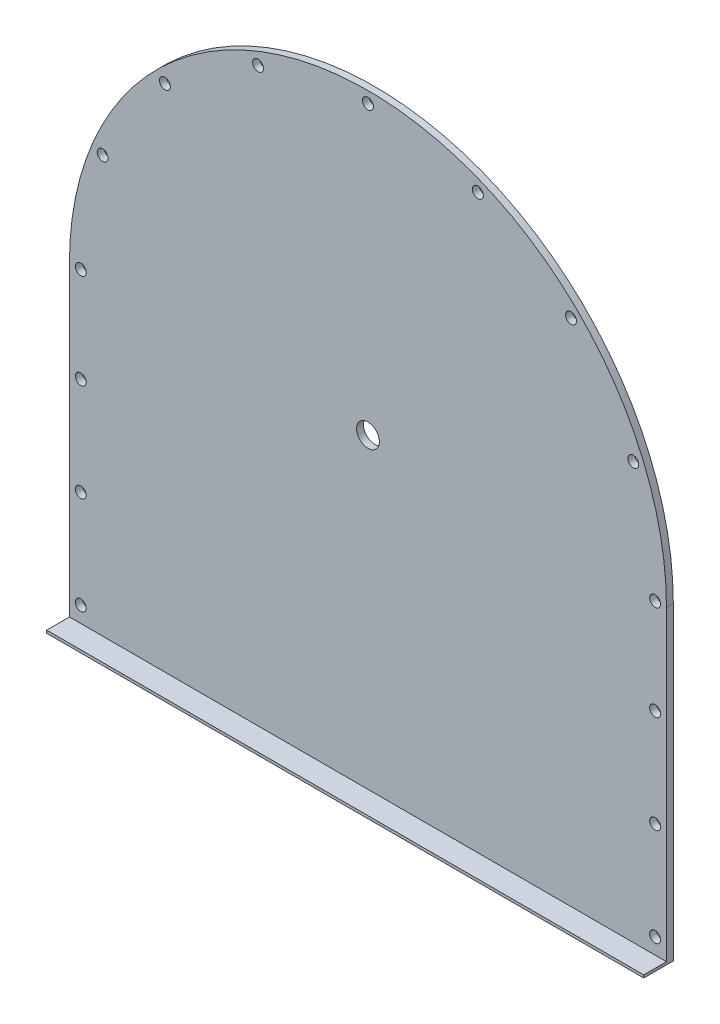
ISO-10303-21;
HEADER;
FILE_DESCRIPTION(('STEP AP214'),'2;1');
FILE_NAME('part.step','',(''),(''),'','','');
FILE_SCHEMA(('AUTOMOTIVE_DESIGN { 1 0 10303 214 1 1 1 1 }'));
ENDSEC;
DATA;
#1=APPLICATION_CONTEXT('core data for automotive mechanical design processes');
#2=APPLICATION_PROTOCOL_DEFINITION('international standard','automotive_design',2000,#1);
#3=PRODUCT_CONTEXT('',#1,'mechanical');
#4=PRODUCT('Part','Part','',(#3));
#5=PRODUCT_RELATED_PRODUCT_CATEGORY('part','',(#4));
#6=PRODUCT_DEFINITION_FORMATION('','',#4);
#7=PRODUCT_DEFINITION_CONTEXT('part definition',#1,'design');
#8=PRODUCT_DEFINITION('design','',#6,#7);
#9=PRODUCT_DEFINITION_SHAPE('','',#8);
#10=(LENGTH_UNIT() NAMED_UNIT(*) SI_UNIT(.MILLI.,.METRE.));
#11=(NAMED_UNIT(*) PLANE_ANGLE_UNIT() SI_UNIT($,.RADIAN.));
#12=(NAMED_UNIT(*) SI_UNIT($,.STERADIAN.) SOLID_ANGLE_UNIT());
#13=UNCERTAINTY_MEASURE_WITH_UNIT(LENGTH_MEASURE(1.E-05),#10,'distance_accuracy_value','');
#14=(GEOMETRIC_REPRESENTATION_CONTEXT(3) GLOBAL_UNCERTAINTY_ASSIGNED_CONTEXT((#13)) GLOBAL_UNIT_ASSIGNED_CONTEXT((#10,
#11,#12)) REPRESENTATION_CONTEXT('',''));
#15=CARTESIAN_POINT('',(0.,0.,0.));
#16=DIRECTION('',(0.,0.,1.));
#17=DIRECTION('',(1.,0.,0.));
#18=AXIS2_PLACEMENT_3D('',#15,#16,#17);
#19=CARTESIAN_POINT('',(0.,0.,15.));
#20=DIRECTION('',(1.,0.,0.));
#21=DIRECTION('',(0.,0.,-1.));
#22=AXIS2_PLACEMENT_3D('',#19,#20,#21);
#23=PLANE('',#22);
#24=DIRECTION('',(0.,-1.,0.));
#25=VECTOR('',#24,1.);
#26=CARTESIAN_POINT('',(0.,0.,0.));
#27=LINE('',#26,#25);
#28=CARTESIAN_POINT('',(0.,680.,0.));
#29=VERTEX_POINT('',#28);
#30=CARTESIAN_POINT('',(0.,0.,0.));
#31=VERTEX_POINT('',#30);
#32=EDGE_CURVE('E94',#29,#31,#27,.T.);
#33=ORIENTED_EDGE('',*,*,#32,.T.);
#34=DIRECTION('',(0.,0.,-1.));
#35=VECTOR('',#34,1.);
#36=CARTESIAN_POINT('',(0.,0.,15.));
#37=LINE('',#36,#35);
#38=CARTESIAN_POINT('',(0.,0.,65.));
#39=VERTEX_POINT('',#38);
#40=EDGE_CURVE('E11',#39,#31,#37,.T.);
#41=ORIENTED_EDGE('',*,*,#40,.F.);
#42=DIRECTION('',(0.,-1.,0.));
#43=VECTOR('',#42,1.);
#44=CARTESIAN_POINT('',(0.,0.,65.));
#45=LINE('',#44,#43);
#46=CARTESIAN_POINT('',(0.,6.00000000000001,65.));
#47=VERTEX_POINT('',#46);
#48=EDGE_CURVE('E131',#47,#39,#45,.T.);
#49=ORIENTED_EDGE('',*,*,#48,.F.);
#50=DIRECTION('',(0.,0.,-1.));
#51=VECTOR('',#50,1.);
#52=CARTESIAN_POINT('',(0.,6.00000000000001,65.));
#53=LINE('',#52,#51);
#54=CARTESIAN_POINT('',(0.,6.00000000000001,15.));
#55=VERTEX_POINT('',#54);
#56=EDGE_CURVE('E103',#47,#55,#53,.T.);
#57=ORIENTED_EDGE('',*,*,#56,.T.);
#58=DIRECTION('',(0.,-1.,0.));
#59=VECTOR('',#58,1.);
#60=CARTESIAN_POINT('',(0.,0.,15.));
#61=LINE('',#60,#59);
#62=CARTESIAN_POINT('',(0.,680.,15.));
#63=VERTEX_POINT('',#62);
#64=EDGE_CURVE('E88',#63,#55,#61,.T.);
#65=ORIENTED_EDGE('',*,*,#64,.F.);
#66=DIRECTION('',(0.,0.,-1.));
#67=VECTOR('',#66,1.);
#68=CARTESIAN_POINT('',(0.,680.,15.));
#69=LINE('',#68,#67);
#70=EDGE_CURVE('E81',#63,#29,#69,.T.);
#71=ORIENTED_EDGE('',*,*,#70,.T.);
#72=EDGE_LOOP('',(#33,#41,#49,#57,#65,#71));
#73=FACE_BOUND('',#72,.T.);
#74=ADVANCED_FACE('F39',(#73),#23,.F.);
#75=CARTESIAN_POINT('',(0.,0.,15.));
#76=DIRECTION('',(0.,1.,0.));
#77=DIRECTION('',(0.,0.,1.));
#78=AXIS2_PLACEMENT_3D('',#75,#76,#77);
#79=PLANE('',#78);
#80=DIRECTION('',(1.,0.,0.));
#81=VECTOR('',#80,1.);
#82=CARTESIAN_POINT('',(0.,0.,0.));
#83=LINE('',#82,#81);
#84=CARTESIAN_POINT('',(1312.,0.,0.));
#85=VERTEX_POINT('',#84);
#86=EDGE_CURVE('E98',#31,#85,#83,.T.);
#87=ORIENTED_EDGE('',*,*,#86,.T.);
#88=DIRECTION('',(0.,0.,-1.));
#89=VECTOR('',#88,1.);
#90=CARTESIAN_POINT('',(1312.,0.,15.));
#91=LINE('',#90,#89);
#92=CARTESIAN_POINT('',(1312.,0.,65.));
#93=VERTEX_POINT('',#92);
#94=EDGE_CURVE('E46',#93,#85,#91,.T.);
#95=ORIENTED_EDGE('',*,*,#94,.F.);
#96=DIRECTION('',(1.,0.,0.));
#97=VECTOR('',#96,1.);
#98=CARTESIAN_POINT('',(0.,0.,65.));
#99=LINE('',#98,#97);
#100=EDGE_CURVE('E123',#39,#93,#99,.T.);
#101=ORIENTED_EDGE('',*,*,#100,.F.);
#102=ORIENTED_EDGE('',*,*,#40,.T.);
#103=EDGE_LOOP('',(#87,#95,#101,#102));
#104=FACE_BOUND('',#103,.T.);
#105=ADVANCED_FACE('F121',(#104),#79,.F.);
#106=CARTESIAN_POINT('',(1312.,0.,15.));
#107=DIRECTION('',(-1.,0.,0.));
#108=DIRECTION('',(0.,0.,1.));
#109=AXIS2_PLACEMENT_3D('',#106,#107,#108);
#110=PLANE('',#109);
#111=DIRECTION('',(0.,1.,0.));
#112=VECTOR('',#111,1.);
#113=CARTESIAN_POINT('',(1312.,0.,0.));
#114=LINE('',#113,#112);
#115=CARTESIAN_POINT('',(1312.,680.,0.));
#116=VERTEX_POINT('',#115);
#117=EDGE_CURVE('E89',#85,#116,#114,.T.);
#118=ORIENTED_EDGE('',*,*,#117,.T.);
#119=DIRECTION('',(0.,0.,-1.));
#120=VECTOR('',#119,1.);
#121=CARTESIAN_POINT('',(1312.,680.,15.));
#122=LINE('',#121,#120);
#123=CARTESIAN_POINT('',(1312.,680.,15.));
#124=VERTEX_POINT('',#123);
#125=EDGE_CURVE('E84',#124,#116,#122,.T.);
#126=ORIENTED_EDGE('',*,*,#125,.F.);
#127=DIRECTION('',(0.,1.,0.));
#128=VECTOR('',#127,1.);
#129=CARTESIAN_POINT('',(1312.,0.,15.));
#130=LINE('',#129,#128);
#131=CARTESIAN_POINT('',(1312.,6.00000000000001,15.));
#132=VERTEX_POINT('',#131);
#133=EDGE_CURVE('E142',#132,#124,#130,.T.);
#134=ORIENTED_EDGE('',*,*,#133,.F.);
#135=DIRECTION('',(0.,0.,-1.));
#136=VECTOR('',#135,1.);
#137=CARTESIAN_POINT('',(1312.,6.00000000000001,65.));
#138=LINE('',#137,#136);
#139=CARTESIAN_POINT('',(1312.,6.00000000000001,65.));
#140=VERTEX_POINT('',#139);
#141=EDGE_CURVE('E99',#140,#132,#138,.T.);
#142=ORIENTED_EDGE('',*,*,#141,.F.);
#143=DIRECTION('',(0.,1.,0.));
#144=VECTOR('',#143,1.);
#145=CARTESIAN_POINT('',(1312.,0.,65.));
#146=LINE('',#145,#144);
#147=EDGE_CURVE('E117',#93,#140,#146,.T.);
#148=ORIENTED_EDGE('',*,*,#147,.F.);
#149=ORIENTED_EDGE('',*,*,#94,.T.);
#150=EDGE_LOOP('',(#118,#126,#134,#142,#148,#149));
#151=FACE_BOUND('',#150,.T.);
#152=ADVANCED_FACE('F113',(#151),#110,.F.);
#153=CARTESIAN_POINT('',(656.,680.,15.));
#154=DIRECTION('',(0.,0.,-1.));
#155=DIRECTION('',(-1.,0.,0.));
#156=AXIS2_PLACEMENT_3D('',#153,#154,#155);
#157=CYLINDRICAL_SURFACE('',#156,656.);
#158=CARTESIAN_POINT('',(656.,680.,0.));
#159=DIRECTION('',(0.,0.,1.));
#160=DIRECTION('',(1.,0.,0.));
#161=AXIS2_PLACEMENT_3D('',#158,#159,#160);
#162=CIRCLE('',#161,656.);
#163=EDGE_CURVE('E78',#116,#29,#162,.T.);
#164=ORIENTED_EDGE('',*,*,#163,.T.);
#165=ORIENTED_EDGE('',*,*,#70,.F.);
#166=CARTESIAN_POINT('',(656.,680.,15.));
#167=DIRECTION('',(0.,0.,1.));
#168=DIRECTION('',(1.,0.,0.));
#169=AXIS2_PLACEMENT_3D('',#166,#167,#168);
#170=CIRCLE('',#169,656.);
#171=EDGE_CURVE('E59',#124,#63,#170,.T.);
#172=ORIENTED_EDGE('',*,*,#171,.F.);
#173=ORIENTED_EDGE('',*,*,#125,.T.);
#174=EDGE_LOOP('',(#164,#165,#172,#173));
#175=FACE_BOUND('',#174,.T.);
#176=ADVANCED_FACE('F80',(#175),#157,.T.);
#177=CARTESIAN_POINT('',(656.,680.,15.));
#178=DIRECTION('',(0.,0.,1.));
#179=DIRECTION('',(1.,0.,0.));
#180=AXIS2_PLACEMENT_3D('',#177,#178,#179);
#181=PLANE('',#180);
#182=CARTESIAN_POINT('',(656.,680.,15.));
#183=DIRECTION('',(0.,0.,1.));
#184=DIRECTION('',(1.,0.,0.));
#185=AXIS2_PLACEMENT_3D('',#182,#183,#184);
#186=CIRCLE('',#185,25.);
#187=CARTESIAN_POINT('',(681.,680.,15.));
#188=VERTEX_POINT('',#187);
#189=EDGE_CURVE('E181',#188,#188,#186,.T.);
#190=ORIENTED_EDGE('',*,*,#189,.F.);
#191=EDGE_LOOP('',(#190));
#192=FACE_BOUND('',#191,.T.);
#193=CARTESIAN_POINT('',(1287.,41.,15.));
#194=DIRECTION('',(0.,0.,1.));
#195=DIRECTION('',(1.,0.,0.));
#196=AXIS2_PLACEMENT_3D('',#193,#194,#195);
#197=CIRCLE('',#196,12.);
#198=CARTESIAN_POINT('',(1299.,41.,15.));
#199=VERTEX_POINT('',#198);
#200=EDGE_CURVE('E185',#199,#199,#197,.T.);
#201=ORIENTED_EDGE('',*,*,#200,.F.);
#202=EDGE_LOOP('',(#201));
#203=FACE_BOUND('',#202,.T.);
#204=CARTESIAN_POINT('',(1287.,256.,15.));
#205=DIRECTION('',(0.,0.,1.));
#206=DIRECTION('',(1.,0.,0.));
#207=AXIS2_PLACEMENT_3D('',#204,#205,#206);
#208=CIRCLE('',#207,12.);
#209=CARTESIAN_POINT('',(1299.,256.,15.));
#210=VERTEX_POINT('',#209);
#211=EDGE_CURVE('E189',#210,#210,#208,.T.);
#212=ORIENTED_EDGE('',*,*,#211,.F.);
#213=EDGE_LOOP('',(#212));
#214=FACE_BOUND('',#213,.T.);
#215=CARTESIAN_POINT('',(1287.,471.,15.));
#216=DIRECTION('',(0.,0.,1.));
#217=DIRECTION('',(1.,0.,0.));
#218=AXIS2_PLACEMENT_3D('',#215,#216,#217);
#219=CIRCLE('',#218,12.);
#220=CARTESIAN_POINT('',(1299.,471.,15.));
#221=VERTEX_POINT('',#220);
#222=EDGE_CURVE('E193',#221,#221,#219,.T.);
#223=ORIENTED_EDGE('',*,*,#222,.F.);
#224=EDGE_LOOP('',(#223));
#225=FACE_BOUND('',#224,.T.);
#226=CARTESIAN_POINT('',(25.,471.,15.));
#227=DIRECTION('',(0.,0.,1.));
#228=DIRECTION('',(1.,0.,0.));
#229=AXIS2_PLACEMENT_3D('',#226,#227,#228);
#230=CIRCLE('',#229,12.);
#231=CARTESIAN_POINT('',(37.,471.,15.));
#232=VERTEX_POINT('',#231);
#233=EDGE_CURVE('E197',#232,#232,#230,.T.);
#234=ORIENTED_EDGE('',*,*,#233,.F.);
#235=EDGE_LOOP('',(#234));
#236=FACE_BOUND('',#235,.T.);
#237=CARTESIAN_POINT('',(25.0000000000001,256.,15.));
#238=DIRECTION('',(0.,0.,1.));
#239=DIRECTION('',(1.,0.,0.));
#240=AXIS2_PLACEMENT_3D('',#237,#238,#239);
#241=CIRCLE('',#240,12.);
#242=CARTESIAN_POINT('',(37.0000000000001,256.,15.));
#243=VERTEX_POINT('',#242);
#244=EDGE_CURVE('E201',#243,#243,#241,.T.);
#245=ORIENTED_EDGE('',*,*,#244,.F.);
#246=EDGE_LOOP('',(#245));
#247=FACE_BOUND('',#246,.T.);
#248=CARTESIAN_POINT('',(25.0000000000001,41.,15.));
#249=DIRECTION('',(0.,0.,1.));
#250=DIRECTION('',(1.,0.,0.));
#251=AXIS2_PLACEMENT_3D('',#248,#249,#250);
#252=CIRCLE('',#251,12.);
#253=CARTESIAN_POINT('',(37.0000000000001,41.,15.));
#254=VERTEX_POINT('',#253);
#255=EDGE_CURVE('E205',#254,#254,#252,.T.);
#256=ORIENTED_EDGE('',*,*,#255,.F.);
#257=EDGE_LOOP('',(#256));
#258=FACE_BOUND('',#257,.T.);
#259=CARTESIAN_POINT('',(1287.,680.,15.));
#260=DIRECTION('',(0.,0.,1.));
#261=DIRECTION('',(1.,0.,0.));
#262=AXIS2_PLACEMENT_3D('',#259,#260,#261);
#263=CIRCLE('',#262,12.);
#264=CARTESIAN_POINT('',(1299.,680.,15.));
#265=VERTEX_POINT('',#264);
#266=EDGE_CURVE('E209',#265,#265,#263,.T.);
#267=ORIENTED_EDGE('',*,*,#266,.F.);
#268=EDGE_LOOP('',(#267));
#269=FACE_BOUND('',#268,.T.);
#270=CARTESIAN_POINT('',(1238.96798501462,921.473245822372,15.));
#271=DIRECTION('',(0.,0.,1.));
#272=DIRECTION('',(1.,0.,0.));
#273=AXIS2_PLACEMENT_3D('',#270,#271,#272);
#274=CIRCLE('',#273,12.);
#275=CARTESIAN_POINT('',(1250.96798501462,921.473245822372,15.));
#276=VERTEX_POINT('',#275);
#277=EDGE_CURVE('E213',#276,#276,#274,.T.);
#278=ORIENTED_EDGE('',*,*,#277,.F.);
#279=EDGE_LOOP('',(#278));
#280=FACE_BOUND('',#279,.T.);
#281=CARTESIAN_POINT('',(1102.18437892871,1126.18437892871,15.));
#282=DIRECTION('',(0.,0.,1.));
#283=DIRECTION('',(1.,0.,0.));
#284=AXIS2_PLACEMENT_3D('',#281,#282,#283);
#285=CIRCLE('',#284,12.);
#286=CARTESIAN_POINT('',(1114.18437892871,1126.18437892871,15.));
#287=VERTEX_POINT('',#286);
#288=EDGE_CURVE('E217',#287,#287,#285,.T.);
#289=ORIENTED_EDGE('',*,*,#288,.F.);
#290=EDGE_LOOP('',(#289));
#291=FACE_BOUND('',#290,.T.);
#292=CARTESIAN_POINT('',(897.47324582237,1262.96798501462,15.));
#293=DIRECTION('',(0.,0.,1.));
#294=DIRECTION('',(1.,0.,0.));
#295=AXIS2_PLACEMENT_3D('',#292,#293,#294);
#296=CIRCLE('',#295,12.);
#297=CARTESIAN_POINT('',(909.47324582237,1262.96798501462,15.));
#298=VERTEX_POINT('',#297);
#299=EDGE_CURVE('E221',#298,#298,#296,.T.);
#300=ORIENTED_EDGE('',*,*,#299,.F.);
#301=EDGE_LOOP('',(#300));
#302=FACE_BOUND('',#301,.T.);
#303=CARTESIAN_POINT('',(655.999999999998,1311.,15.));
#304=DIRECTION('',(0.,0.,1.));
#305=DIRECTION('',(1.,0.,0.));
#306=AXIS2_PLACEMENT_3D('',#303,#304,#305);
#307=CIRCLE('',#306,12.);
#308=CARTESIAN_POINT('',(667.999999999998,1311.,15.));
#309=VERTEX_POINT('',#308);
#310=EDGE_CURVE('E225',#309,#309,#307,.T.);
#311=ORIENTED_EDGE('',*,*,#310,.F.);
#312=EDGE_LOOP('',(#311));
#313=FACE_BOUND('',#312,.T.);
#314=CARTESIAN_POINT('',(414.526754177625,1262.96798501462,15.));
#315=DIRECTION('',(0.,0.,1.));
#316=DIRECTION('',(1.,0.,0.));
#317=AXIS2_PLACEMENT_3D('',#314,#315,#316);
#318=CIRCLE('',#317,12.);
#319=CARTESIAN_POINT('',(426.526754177625,1262.96798501462,15.));
#320=VERTEX_POINT('',#319);
#321=EDGE_CURVE('E229',#320,#320,#318,.T.);
#322=ORIENTED_EDGE('',*,*,#321,.F.);
#323=EDGE_LOOP('',(#322));
#324=FACE_BOUND('',#323,.T.);
#325=CARTESIAN_POINT('',(209.815621071286,1126.18437892871,15.));
#326=DIRECTION('',(0.,0.,1.));
#327=DIRECTION('',(1.,0.,0.));
#328=AXIS2_PLACEMENT_3D('',#325,#326,#327);
#329=CIRCLE('',#328,12.);
#330=CARTESIAN_POINT('',(221.815621071286,1126.18437892871,15.));
#331=VERTEX_POINT('',#330);
#332=EDGE_CURVE('E233',#331,#331,#329,.T.);
#333=ORIENTED_EDGE('',*,*,#332,.F.);
#334=EDGE_LOOP('',(#333));
#335=FACE_BOUND('',#334,.T.);
#336=CARTESIAN_POINT('',(73.0320149853765,921.473245822368,15.));
#337=DIRECTION('',(0.,0.,1.));
#338=DIRECTION('',(1.,0.,0.));
#339=AXIS2_PLACEMENT_3D('',#336,#337,#338);
#340=CIRCLE('',#339,12.);
#341=CARTESIAN_POINT('',(85.0320149853765,921.473245822368,15.));
#342=VERTEX_POINT('',#341);
#343=EDGE_CURVE('E237',#342,#342,#340,.T.);
#344=ORIENTED_EDGE('',*,*,#343,.F.);
#345=EDGE_LOOP('',(#344));
#346=FACE_BOUND('',#345,.T.);
#347=CARTESIAN_POINT('',(25.0000000000001,679.999999999996,15.));
#348=DIRECTION('',(0.,0.,1.));
#349=DIRECTION('',(1.,0.,0.));
#350=AXIS2_PLACEMENT_3D('',#347,#348,#349);
#351=CIRCLE('',#350,12.);
#352=CARTESIAN_POINT('',(37.0000000000001,679.999999999996,15.));
#353=VERTEX_POINT('',#352);
#354=EDGE_CURVE('E240',#353,#353,#351,.T.);
#355=ORIENTED_EDGE('',*,*,#354,.F.);
#356=EDGE_LOOP('',(#355));
#357=FACE_BOUND('',#356,.T.);
#358=DIRECTION('',(-1.,0.,0.));
#359=VECTOR('',#358,1.);
#360=CARTESIAN_POINT('',(0.,6.00000000000001,15.));
#361=LINE('',#360,#359);
#362=EDGE_CURVE('E53',#132,#55,#361,.T.);
#363=ORIENTED_EDGE('',*,*,#362,.F.);
#364=ORIENTED_EDGE('',*,*,#133,.T.);
#365=ORIENTED_EDGE('',*,*,#171,.T.);
#366=ORIENTED_EDGE('',*,*,#64,.T.);
#367=EDGE_LOOP('',(#363,#364,#365,#366));
#368=FACE_BOUND('',#367,.T.);
#369=ADVANCED_FACE('F143',(#192,#203,#214,#225,#236,#247,#258,#269,#280,#291,#302,#313,#324,
#335,#346,#357,#368),#181,.T.);
#370=CARTESIAN_POINT('',(656.,680.,0.));
#371=DIRECTION('',(0.,0.,1.));
#372=DIRECTION('',(1.,0.,0.));
#373=AXIS2_PLACEMENT_3D('',#370,#371,#372);
#374=PLANE('',#373);
#375=CARTESIAN_POINT('',(656.,680.,0.));
#376=DIRECTION('',(0.,0.,1.));
#377=DIRECTION('',(1.,0.,0.));
#378=AXIS2_PLACEMENT_3D('',#375,#376,#377);
#379=CIRCLE('',#378,25.);
#380=CARTESIAN_POINT('',(681.,680.,0.));
#381=VERTEX_POINT('',#380);
#382=EDGE_CURVE('E301',#381,#381,#379,.T.);
#383=ORIENTED_EDGE('',*,*,#382,.T.);
#384=EDGE_LOOP('',(#383));
#385=FACE_BOUND('',#384,.T.);
#386=CARTESIAN_POINT('',(1287.,41.,0.));
#387=DIRECTION('',(0.,0.,1.));
#388=DIRECTION('',(1.,0.,0.));
#389=AXIS2_PLACEMENT_3D('',#386,#387,#388);
#390=CIRCLE('',#389,12.);
#391=CARTESIAN_POINT('',(1299.,41.,0.));
#392=VERTEX_POINT('',#391);
#393=EDGE_CURVE('E297',#392,#392,#390,.T.);
#394=ORIENTED_EDGE('',*,*,#393,.T.);
#395=EDGE_LOOP('',(#394));
#396=FACE_BOUND('',#395,.T.);
#397=CARTESIAN_POINT('',(1287.,256.,0.));
#398=DIRECTION('',(0.,0.,1.));
#399=DIRECTION('',(1.,0.,0.));
#400=AXIS2_PLACEMENT_3D('',#397,#398,#399);
#401=CIRCLE('',#400,12.);
#402=CARTESIAN_POINT('',(1299.,256.,0.));
#403=VERTEX_POINT('',#402);
#404=EDGE_CURVE('E293',#403,#403,#401,.T.);
#405=ORIENTED_EDGE('',*,*,#404,.T.);
#406=EDGE_LOOP('',(#405));
#407=FACE_BOUND('',#406,.T.);
#408=CARTESIAN_POINT('',(1287.,471.,0.));
#409=DIRECTION('',(0.,0.,1.));
#410=DIRECTION('',(1.,0.,0.));
#411=AXIS2_PLACEMENT_3D('',#408,#409,#410);
#412=CIRCLE('',#411,12.);
#413=CARTESIAN_POINT('',(1299.,471.,0.));
#414=VERTEX_POINT('',#413);
#415=EDGE_CURVE('E289',#414,#414,#412,.T.);
#416=ORIENTED_EDGE('',*,*,#415,.T.);
#417=EDGE_LOOP('',(#416));
#418=FACE_BOUND('',#417,.T.);
#419=CARTESIAN_POINT('',(25.,471.,0.));
#420=DIRECTION('',(0.,0.,1.));
#421=DIRECTION('',(1.,0.,0.));
#422=AXIS2_PLACEMENT_3D('',#419,#420,#421);
#423=CIRCLE('',#422,12.);
#424=CARTESIAN_POINT('',(37.,471.,0.));
#425=VERTEX_POINT('',#424);
#426=EDGE_CURVE('E285',#425,#425,#423,.T.);
#427=ORIENTED_EDGE('',*,*,#426,.T.);
#428=EDGE_LOOP('',(#427));
#429=FACE_BOUND('',#428,.T.);
#430=CARTESIAN_POINT('',(25.0000000000001,256.,0.));
#431=DIRECTION('',(0.,0.,1.));
#432=DIRECTION('',(1.,0.,0.));
#433=AXIS2_PLACEMENT_3D('',#430,#431,#432);
#434=CIRCLE('',#433,12.);
#435=CARTESIAN_POINT('',(37.0000000000001,256.,0.));
#436=VERTEX_POINT('',#435);
#437=EDGE_CURVE('E281',#436,#436,#434,.T.);
#438=ORIENTED_EDGE('',*,*,#437,.T.);
#439=EDGE_LOOP('',(#438));
#440=FACE_BOUND('',#439,.T.);
#441=CARTESIAN_POINT('',(25.0000000000001,41.,0.));
#442=DIRECTION('',(0.,0.,1.));
#443=DIRECTION('',(1.,0.,0.));
#444=AXIS2_PLACEMENT_3D('',#441,#442,#443);
#445=CIRCLE('',#444,12.);
#446=CARTESIAN_POINT('',(37.0000000000001,41.,0.));
#447=VERTEX_POINT('',#446);
#448=EDGE_CURVE('E277',#447,#447,#445,.T.);
#449=ORIENTED_EDGE('',*,*,#448,.T.);
#450=EDGE_LOOP('',(#449));
#451=FACE_BOUND('',#450,.T.);
#452=CARTESIAN_POINT('',(1287.,680.,0.));
#453=DIRECTION('',(0.,0.,1.));
#454=DIRECTION('',(1.,0.,0.));
#455=AXIS2_PLACEMENT_3D('',#452,#453,#454);
#456=CIRCLE('',#455,12.);
#457=CARTESIAN_POINT('',(1299.,680.,0.));
#458=VERTEX_POINT('',#457);
#459=EDGE_CURVE('E273',#458,#458,#456,.T.);
#460=ORIENTED_EDGE('',*,*,#459,.T.);
#461=EDGE_LOOP('',(#460));
#462=FACE_BOUND('',#461,.T.);
#463=CARTESIAN_POINT('',(1238.96798501462,921.473245822372,0.));
#464=DIRECTION('',(0.,0.,1.));
#465=DIRECTION('',(1.,0.,0.));
#466=AXIS2_PLACEMENT_3D('',#463,#464,#465);
#467=CIRCLE('',#466,12.);
#468=CARTESIAN_POINT('',(1250.96798501462,921.473245822372,0.));
#469=VERTEX_POINT('',#468);
#470=EDGE_CURVE('E269',#469,#469,#467,.T.);
#471=ORIENTED_EDGE('',*,*,#470,.T.);
#472=EDGE_LOOP('',(#471));
#473=FACE_BOUND('',#472,.T.);
#474=CARTESIAN_POINT('',(1102.18437892871,1126.18437892871,0.));
#475=DIRECTION('',(0.,0.,1.));
#476=DIRECTION('',(1.,0.,0.));
#477=AXIS2_PLACEMENT_3D('',#474,#475,#476);
#478=CIRCLE('',#477,12.);
#479=CARTESIAN_POINT('',(1114.18437892871,1126.18437892871,0.));
#480=VERTEX_POINT('',#479);
#481=EDGE_CURVE('E265',#480,#480,#478,.T.);
#482=ORIENTED_EDGE('',*,*,#481,.T.);
#483=EDGE_LOOP('',(#482));
#484=FACE_BOUND('',#483,.T.);
#485=CARTESIAN_POINT('',(897.47324582237,1262.96798501462,0.));
#486=DIRECTION('',(0.,0.,1.));
#487=DIRECTION('',(1.,0.,0.));
#488=AXIS2_PLACEMENT_3D('',#485,#486,#487);
#489=CIRCLE('',#488,12.);
#490=CARTESIAN_POINT('',(909.47324582237,1262.96798501462,0.));
#491=VERTEX_POINT('',#490);
#492=EDGE_CURVE('E261',#491,#491,#489,.T.);
#493=ORIENTED_EDGE('',*,*,#492,.T.);
#494=EDGE_LOOP('',(#493));
#495=FACE_BOUND('',#494,.T.);
#496=CARTESIAN_POINT('',(655.999999999998,1311.,0.));
#497=DIRECTION('',(0.,0.,1.));
#498=DIRECTION('',(1.,0.,0.));
#499=AXIS2_PLACEMENT_3D('',#496,#497,#498);
#500=CIRCLE('',#499,12.);
#501=CARTESIAN_POINT('',(667.999999999998,1311.,0.));
#502=VERTEX_POINT('',#501);
#503=EDGE_CURVE('E257',#502,#502,#500,.T.);
#504=ORIENTED_EDGE('',*,*,#503,.T.);
#505=EDGE_LOOP('',(#504));
#506=FACE_BOUND('',#505,.T.);
#507=CARTESIAN_POINT('',(414.526754177625,1262.96798501462,0.));
#508=DIRECTION('',(0.,0.,1.));
#509=DIRECTION('',(1.,0.,0.));
#510=AXIS2_PLACEMENT_3D('',#507,#508,#509);
#511=CIRCLE('',#510,12.);
#512=CARTESIAN_POINT('',(426.526754177625,1262.96798501462,0.));
#513=VERTEX_POINT('',#512);
#514=EDGE_CURVE('E253',#513,#513,#511,.T.);
#515=ORIENTED_EDGE('',*,*,#514,.T.);
#516=EDGE_LOOP('',(#515));
#517=FACE_BOUND('',#516,.T.);
#518=CARTESIAN_POINT('',(209.815621071286,1126.18437892871,0.));
#519=DIRECTION('',(0.,0.,1.));
#520=DIRECTION('',(1.,0.,0.));
#521=AXIS2_PLACEMENT_3D('',#518,#519,#520);
#522=CIRCLE('',#521,12.);
#523=CARTESIAN_POINT('',(221.815621071286,1126.18437892871,0.));
#524=VERTEX_POINT('',#523);
#525=EDGE_CURVE('E249',#524,#524,#522,.T.);
#526=ORIENTED_EDGE('',*,*,#525,.T.);
#527=EDGE_LOOP('',(#526));
#528=FACE_BOUND('',#527,.T.);
#529=CARTESIAN_POINT('',(73.0320149853765,921.473245822368,0.));
#530=DIRECTION('',(0.,0.,1.));
#531=DIRECTION('',(1.,0.,0.));
#532=AXIS2_PLACEMENT_3D('',#529,#530,#531);
#533=CIRCLE('',#532,12.);
#534=CARTESIAN_POINT('',(85.0320149853765,921.473245822368,0.));
#535=VERTEX_POINT('',#534);
#536=EDGE_CURVE('E242',#535,#535,#533,.T.);
#537=ORIENTED_EDGE('',*,*,#536,.T.);
#538=EDGE_LOOP('',(#537));
#539=FACE_BOUND('',#538,.T.);
#540=CARTESIAN_POINT('',(25.0000000000001,679.999999999996,0.));
#541=DIRECTION('',(0.,0.,1.));
#542=DIRECTION('',(1.,0.,0.));
#543=AXIS2_PLACEMENT_3D('',#540,#541,#542);
#544=CIRCLE('',#543,12.);
#545=CARTESIAN_POINT('',(37.0000000000001,679.999999999996,0.));
#546=VERTEX_POINT('',#545);
#547=EDGE_CURVE('E140',#546,#546,#544,.T.);
#548=ORIENTED_EDGE('',*,*,#547,.T.);
#549=EDGE_LOOP('',(#548));
#550=FACE_BOUND('',#549,.T.);
#551=ORIENTED_EDGE('',*,*,#32,.F.);
#552=ORIENTED_EDGE('',*,*,#163,.F.);
#553=ORIENTED_EDGE('',*,*,#117,.F.);
#554=ORIENTED_EDGE('',*,*,#86,.F.);
#555=EDGE_LOOP('',(#551,#552,#553,#554));
#556=FACE_BOUND('',#555,.T.);
#557=ADVANCED_FACE('F97',(#385,#396,#407,#418,#429,#440,#451,#462,#473,#484,#495,#506,#517,#528,
#539,#550,#556),#374,.F.);
#558=CARTESIAN_POINT('',(0.,6.00000000000001,65.));
#559=DIRECTION('',(0.,-1.,0.));
#560=DIRECTION('',(0.,0.,-1.));
#561=AXIS2_PLACEMENT_3D('',#558,#559,#560);
#562=PLANE('',#561);
#563=ORIENTED_EDGE('',*,*,#362,.T.);
#564=ORIENTED_EDGE('',*,*,#56,.F.);
#565=DIRECTION('',(-1.,0.,0.));
#566=VECTOR('',#565,1.);
#567=CARTESIAN_POINT('',(0.,6.00000000000001,65.));
#568=LINE('',#567,#566);
#569=EDGE_CURVE('E133',#140,#47,#568,.T.);
#570=ORIENTED_EDGE('',*,*,#569,.F.);
#571=ORIENTED_EDGE('',*,*,#141,.T.);
#572=EDGE_LOOP('',(#563,#564,#570,#571));
#573=FACE_BOUND('',#572,.T.);
#574=ADVANCED_FACE('F146',(#573),#562,.F.);
#575=CARTESIAN_POINT('',(0.,0.,65.));
#576=DIRECTION('',(0.,0.,-1.));
#577=DIRECTION('',(-1.,0.,0.));
#578=AXIS2_PLACEMENT_3D('',#575,#576,#577);
#579=PLANE('',#578);
#580=ORIENTED_EDGE('',*,*,#48,.T.);
#581=ORIENTED_EDGE('',*,*,#100,.T.);
#582=ORIENTED_EDGE('',*,*,#147,.T.);
#583=ORIENTED_EDGE('',*,*,#569,.T.);
#584=EDGE_LOOP('',(#580,#581,#582,#583));
#585=FACE_BOUND('',#584,.T.);
#586=ADVANCED_FACE('F128',(#585),#579,.F.);
#587=CARTESIAN_POINT('',(25.0000000000001,679.999999999996,15.));
#588=DIRECTION('',(0.,0.,1.));
#589=DIRECTION('',(1.,0.,0.));
#590=AXIS2_PLACEMENT_3D('',#587,#588,#589);
#591=CYLINDRICAL_SURFACE('',#590,12.);
#592=ORIENTED_EDGE('',*,*,#547,.F.);
#593=EDGE_LOOP('',(#592));
#594=FACE_BOUND('',#593,.T.);
#595=ORIENTED_EDGE('',*,*,#354,.T.);
#596=EDGE_LOOP('',(#595));
#597=FACE_BOUND('',#596,.T.);
#598=ADVANCED_FACE('F158',(#594,#597),#591,.F.);
#599=CARTESIAN_POINT('',(73.0320149853765,921.473245822368,15.));
#600=DIRECTION('',(0.,0.,1.));
#601=DIRECTION('',(1.,0.,0.));
#602=AXIS2_PLACEMENT_3D('',#599,#600,#601);
#603=CYLINDRICAL_SURFACE('',#602,12.);
#604=ORIENTED_EDGE('',*,*,#536,.F.);
#605=EDGE_LOOP('',(#604));
#606=FACE_BOUND('',#605,.T.);
#607=ORIENTED_EDGE('',*,*,#343,.T.);
#608=EDGE_LOOP('',(#607));
#609=FACE_BOUND('',#608,.T.);
#610=ADVANCED_FACE('F364',(#606,#609),#603,.F.);
#611=CARTESIAN_POINT('',(209.815621071286,1126.18437892871,15.));
#612=DIRECTION('',(0.,0.,1.));
#613=DIRECTION('',(1.,0.,0.));
#614=AXIS2_PLACEMENT_3D('',#611,#612,#613);
#615=CYLINDRICAL_SURFACE('',#614,12.);
#616=ORIENTED_EDGE('',*,*,#525,.F.);
#617=EDGE_LOOP('',(#616));
#618=FACE_BOUND('',#617,.T.);
#619=ORIENTED_EDGE('',*,*,#332,.T.);
#620=EDGE_LOOP('',(#619));
#621=FACE_BOUND('',#620,.T.);
#622=ADVANCED_FACE('F360',(#618,#621),#615,.F.);
#623=CARTESIAN_POINT('',(414.526754177625,1262.96798501462,15.));
#624=DIRECTION('',(0.,0.,1.));
#625=DIRECTION('',(1.,0.,0.));
#626=AXIS2_PLACEMENT_3D('',#623,#624,#625);
#627=CYLINDRICAL_SURFACE('',#626,12.);
#628=ORIENTED_EDGE('',*,*,#514,.F.);
#629=EDGE_LOOP('',(#628));
#630=FACE_BOUND('',#629,.T.);
#631=ORIENTED_EDGE('',*,*,#321,.T.);
#632=EDGE_LOOP('',(#631));
#633=FACE_BOUND('',#632,.T.);
#634=ADVANCED_FACE('F356',(#630,#633),#627,.F.);
#635=CARTESIAN_POINT('',(655.999999999998,1311.,15.));
#636=DIRECTION('',(0.,0.,1.));
#637=DIRECTION('',(1.,0.,0.));
#638=AXIS2_PLACEMENT_3D('',#635,#636,#637);
#639=CYLINDRICAL_SURFACE('',#638,12.);
#640=ORIENTED_EDGE('',*,*,#503,.F.);
#641=EDGE_LOOP('',(#640));
#642=FACE_BOUND('',#641,.T.);
#643=ORIENTED_EDGE('',*,*,#310,.T.);
#644=EDGE_LOOP('',(#643));
#645=FACE_BOUND('',#644,.T.);
#646=ADVANCED_FACE('F352',(#642,#645),#639,.F.);
#647=CARTESIAN_POINT('',(897.47324582237,1262.96798501462,15.));
#648=DIRECTION('',(0.,0.,1.));
#649=DIRECTION('',(1.,0.,0.));
#650=AXIS2_PLACEMENT_3D('',#647,#648,#649);
#651=CYLINDRICAL_SURFACE('',#650,12.);
#652=ORIENTED_EDGE('',*,*,#492,.F.);
#653=EDGE_LOOP('',(#652));
#654=FACE_BOUND('',#653,.T.);
#655=ORIENTED_EDGE('',*,*,#299,.T.);
#656=EDGE_LOOP('',(#655));
#657=FACE_BOUND('',#656,.T.);
#658=ADVANCED_FACE('F348',(#654,#657),#651,.F.);
#659=CARTESIAN_POINT('',(1102.18437892871,1126.18437892871,15.));
#660=DIRECTION('',(0.,0.,1.));
#661=DIRECTION('',(1.,0.,0.));
#662=AXIS2_PLACEMENT_3D('',#659,#660,#661);
#663=CYLINDRICAL_SURFACE('',#662,12.);
#664=ORIENTED_EDGE('',*,*,#481,.F.);
#665=EDGE_LOOP('',(#664));
#666=FACE_BOUND('',#665,.T.);
#667=ORIENTED_EDGE('',*,*,#288,.T.);
#668=EDGE_LOOP('',(#667));
#669=FACE_BOUND('',#668,.T.);
#670=ADVANCED_FACE('F344',(#666,#669),#663,.F.);
#671=CARTESIAN_POINT('',(1238.96798501462,921.473245822372,15.));
#672=DIRECTION('',(0.,0.,1.));
#673=DIRECTION('',(1.,0.,0.));
#674=AXIS2_PLACEMENT_3D('',#671,#672,#673);
#675=CYLINDRICAL_SURFACE('',#674,12.);
#676=ORIENTED_EDGE('',*,*,#470,.F.);
#677=EDGE_LOOP('',(#676));
#678=FACE_BOUND('',#677,.T.);
#679=ORIENTED_EDGE('',*,*,#277,.T.);
#680=EDGE_LOOP('',(#679));
#681=FACE_BOUND('',#680,.T.);
#682=ADVANCED_FACE('F340',(#678,#681),#675,.F.);
#683=CARTESIAN_POINT('',(1287.,680.,15.));
#684=DIRECTION('',(0.,0.,1.));
#685=DIRECTION('',(1.,0.,0.));
#686=AXIS2_PLACEMENT_3D('',#683,#684,#685);
#687=CYLINDRICAL_SURFACE('',#686,12.);
#688=ORIENTED_EDGE('',*,*,#459,.F.);
#689=EDGE_LOOP('',(#688));
#690=FACE_BOUND('',#689,.T.);
#691=ORIENTED_EDGE('',*,*,#266,.T.);
#692=EDGE_LOOP('',(#691));
#693=FACE_BOUND('',#692,.T.);
#694=ADVANCED_FACE('F336',(#690,#693),#687,.F.);
#695=CARTESIAN_POINT('',(25.0000000000001,41.,15.));
#696=DIRECTION('',(0.,0.,1.));
#697=DIRECTION('',(1.,0.,0.));
#698=AXIS2_PLACEMENT_3D('',#695,#696,#697);
#699=CYLINDRICAL_SURFACE('',#698,12.);
#700=ORIENTED_EDGE('',*,*,#448,.F.);
#701=EDGE_LOOP('',(#700));
#702=FACE_BOUND('',#701,.T.);
#703=ORIENTED_EDGE('',*,*,#255,.T.);
#704=EDGE_LOOP('',(#703));
#705=FACE_BOUND('',#704,.T.);
#706=ADVANCED_FACE('F332',(#702,#705),#699,.F.);
#707=CARTESIAN_POINT('',(25.0000000000001,256.,15.));
#708=DIRECTION('',(0.,0.,1.));
#709=DIRECTION('',(1.,0.,0.));
#710=AXIS2_PLACEMENT_3D('',#707,#708,#709);
#711=CYLINDRICAL_SURFACE('',#710,12.);
#712=ORIENTED_EDGE('',*,*,#437,.F.);
#713=EDGE_LOOP('',(#712));
#714=FACE_BOUND('',#713,.T.);
#715=ORIENTED_EDGE('',*,*,#244,.T.);
#716=EDGE_LOOP('',(#715));
#717=FACE_BOUND('',#716,.T.);
#718=ADVANCED_FACE('F328',(#714,#717),#711,.F.);
#719=CARTESIAN_POINT('',(25.,471.,15.));
#720=DIRECTION('',(0.,0.,1.));
#721=DIRECTION('',(1.,0.,0.));
#722=AXIS2_PLACEMENT_3D('',#719,#720,#721);
#723=CYLINDRICAL_SURFACE('',#722,12.);
#724=ORIENTED_EDGE('',*,*,#426,.F.);
#725=EDGE_LOOP('',(#724));
#726=FACE_BOUND('',#725,.T.);
#727=ORIENTED_EDGE('',*,*,#233,.T.);
#728=EDGE_LOOP('',(#727));
#729=FACE_BOUND('',#728,.T.);
#730=ADVANCED_FACE('F324',(#726,#729),#723,.F.);
#731=CARTESIAN_POINT('',(1287.,471.,15.));
#732=DIRECTION('',(0.,0.,1.));
#733=DIRECTION('',(1.,0.,0.));
#734=AXIS2_PLACEMENT_3D('',#731,#732,#733);
#735=CYLINDRICAL_SURFACE('',#734,12.);
#736=ORIENTED_EDGE('',*,*,#415,.F.);
#737=EDGE_LOOP('',(#736));
#738=FACE_BOUND('',#737,.T.);
#739=ORIENTED_EDGE('',*,*,#222,.T.);
#740=EDGE_LOOP('',(#739));
#741=FACE_BOUND('',#740,.T.);
#742=ADVANCED_FACE('F320',(#738,#741),#735,.F.);
#743=CARTESIAN_POINT('',(1287.,256.,15.));
#744=DIRECTION('',(0.,0.,1.));
#745=DIRECTION('',(1.,0.,0.));
#746=AXIS2_PLACEMENT_3D('',#743,#744,#745);
#747=CYLINDRICAL_SURFACE('',#746,12.);
#748=ORIENTED_EDGE('',*,*,#404,.F.);
#749=EDGE_LOOP('',(#748));
#750=FACE_BOUND('',#749,.T.);
#751=ORIENTED_EDGE('',*,*,#211,.T.);
#752=EDGE_LOOP('',(#751));
#753=FACE_BOUND('',#752,.T.);
#754=ADVANCED_FACE('F314',(#750,#753),#747,.F.);
#755=CARTESIAN_POINT('',(1287.,41.,15.));
#756=DIRECTION('',(0.,0.,1.));
#757=DIRECTION('',(1.,0.,0.));
#758=AXIS2_PLACEMENT_3D('',#755,#756,#757);
#759=CYLINDRICAL_SURFACE('',#758,12.);
#760=ORIENTED_EDGE('',*,*,#393,.F.);
#761=EDGE_LOOP('',(#760));
#762=FACE_BOUND('',#761,.T.);
#763=ORIENTED_EDGE('',*,*,#200,.T.);
#764=EDGE_LOOP('',(#763));
#765=FACE_BOUND('',#764,.T.);
#766=ADVANCED_FACE('F310',(#762,#765),#759,.F.);
#767=CARTESIAN_POINT('',(656.,680.,0.));
#768=DIRECTION('',(0.,0.,1.));
#769=DIRECTION('',(1.,0.,0.));
#770=AXIS2_PLACEMENT_3D('',#767,#768,#769);
#771=CYLINDRICAL_SURFACE('',#770,25.);
#772=ORIENTED_EDGE('',*,*,#382,.F.);
#773=EDGE_LOOP('',(#772));
#774=FACE_BOUND('',#773,.T.);
#775=ORIENTED_EDGE('',*,*,#189,.T.);
#776=EDGE_LOOP('',(#775));
#777=FACE_BOUND('',#776,.T.);
#778=ADVANCED_FACE('F307',(#774,#777),#771,.F.);
#779=CLOSED_SHELL('',(#74,#105,#152,#176,#369,#557,#574,#586,#598,#610,#622,#634,#646,#658,#670,
#682,#694,#706,#718,#730,#742,#754,#766,#778));
#780=MANIFOLD_SOLID_BREP('B2',#779);
#781=ADVANCED_BREP_SHAPE_REPRESENTATION('',(#18,#780),#14);
#782=SHAPE_DEFINITION_REPRESENTATION(#9,#781);
ENDSEC;
END-ISO-10303-21;
